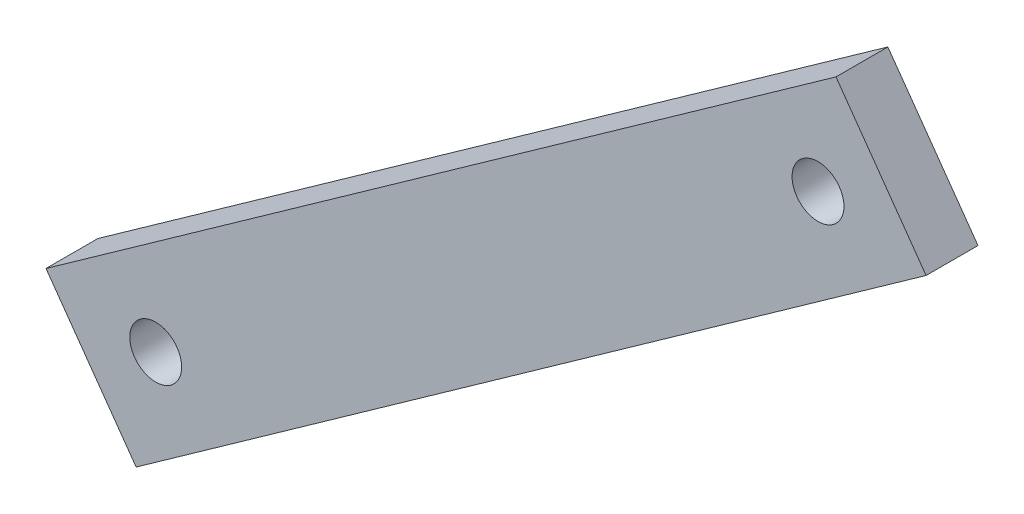
ISO-10303-21;
HEADER;
FILE_DESCRIPTION(('STEP AP214'),'2;1');
FILE_NAME('part.step','',(''),(''),'','','');
FILE_SCHEMA(('AUTOMOTIVE_DESIGN { 1 0 10303 214 1 1 1 1 }'));
ENDSEC;
DATA;
#1=APPLICATION_CONTEXT('core data for automotive mechanical design processes');
#2=APPLICATION_PROTOCOL_DEFINITION('international standard','automotive_design',2000,#1);
#3=PRODUCT_CONTEXT('',#1,'mechanical');
#4=PRODUCT('Part','Part','',(#3));
#5=PRODUCT_RELATED_PRODUCT_CATEGORY('part','',(#4));
#6=PRODUCT_DEFINITION_FORMATION('','',#4);
#7=PRODUCT_DEFINITION_CONTEXT('part definition',#1,'design');
#8=PRODUCT_DEFINITION('design','',#6,#7);
#9=PRODUCT_DEFINITION_SHAPE('','',#8);
#10=(LENGTH_UNIT() NAMED_UNIT(*) SI_UNIT(.MILLI.,.METRE.));
#11=(NAMED_UNIT(*) PLANE_ANGLE_UNIT() SI_UNIT($,.RADIAN.));
#12=(NAMED_UNIT(*) SI_UNIT($,.STERADIAN.) SOLID_ANGLE_UNIT());
#13=UNCERTAINTY_MEASURE_WITH_UNIT(LENGTH_MEASURE(1.E-05),#10,'distance_accuracy_value','');
#14=(GEOMETRIC_REPRESENTATION_CONTEXT(3) GLOBAL_UNCERTAINTY_ASSIGNED_CONTEXT((#13)) GLOBAL_UNIT_ASSIGNED_CONTEXT((#10,
#11,#12)) REPRESENTATION_CONTEXT('',''));
#15=CARTESIAN_POINT('',(0.,0.,0.));
#16=DIRECTION('',(0.,0.,1.));
#17=DIRECTION('',(1.,0.,0.));
#18=AXIS2_PLACEMENT_3D('',#15,#16,#17);
#19=CARTESIAN_POINT('',(-63.3952831679543,2.2391287180899,2.54));
#20=DIRECTION('',(-0.578921919080397,0.815382984620276,0.));
#21=DIRECTION('',(-0.815382984620276,-0.578921919080397,0.));
#22=AXIS2_PLACEMENT_3D('',#19,#20,#21);
#23=PLANE('',#22);
#24=DIRECTION('',(0.815382984620276,0.578921919080397,0.));
#25=VECTOR('',#24,1.);
#26=CARTESIAN_POINT('',(-63.3952831679543,2.2391287180899,0.));
#27=LINE('',#26,#25);
#28=CARTESIAN_POINT('',(-63.3952831679543,2.2391287180899,0.));
#29=VERTEX_POINT('',#28);
#30=CARTESIAN_POINT('',(-24.7283543478885,29.6926481803367,0.));
#31=VERTEX_POINT('',#30);
#32=EDGE_CURVE('E95',#29,#31,#27,.T.);
#33=ORIENTED_EDGE('',*,*,#32,.T.);
#34=DIRECTION('',(0.,0.,-1.));
#35=VECTOR('',#34,1.);
#36=CARTESIAN_POINT('',(-24.7283543478885,29.6926481803367,2.54));
#37=LINE('',#36,#35);
#38=CARTESIAN_POINT('',(-24.7283543478885,29.6926481803367,2.54));
#39=VERTEX_POINT('',#38);
#40=EDGE_CURVE('E11',#39,#31,#37,.T.);
#41=ORIENTED_EDGE('',*,*,#40,.F.);
#42=DIRECTION('',(0.815382984620276,0.578921919080397,0.));
#43=VECTOR('',#42,1.);
#44=CARTESIAN_POINT('',(-63.3952831679543,2.2391287180899,2.54));
#45=LINE('',#44,#43);
#46=CARTESIAN_POINT('',(-63.3952831679543,2.2391287180899,2.54));
#47=VERTEX_POINT('',#46);
#48=EDGE_CURVE('E80',#47,#39,#45,.T.);
#49=ORIENTED_EDGE('',*,*,#48,.F.);
#50=DIRECTION('',(0.,0.,-1.));
#51=VECTOR('',#50,1.);
#52=CARTESIAN_POINT('',(-63.3952831679543,2.2391287180899,2.54));
#53=LINE('',#52,#51);
#54=EDGE_CURVE('E91',#47,#29,#53,.T.);
#55=ORIENTED_EDGE('',*,*,#54,.T.);
#56=EDGE_LOOP('',(#33,#41,#49,#55));
#57=FACE_BOUND('',#56,.T.);
#58=ADVANCED_FACE('F33',(#57),#23,.F.);
#59=CARTESIAN_POINT('',(-24.7283543478885,29.6926481803367,2.54));
#60=DIRECTION('',(-0.815382984620276,-0.578921919080398,0.));
#61=DIRECTION('',(0.578921919080397,-0.815382984620276,0.));
#62=AXIS2_PLACEMENT_3D('',#59,#60,#61);
#63=PLANE('',#62);
#64=DIRECTION('',(-0.578921919080397,0.815382984620276,0.));
#65=VECTOR('',#64,1.);
#66=CARTESIAN_POINT('',(-24.7283543478885,29.6926481803367,0.));
#67=LINE('',#66,#65);
#68=CARTESIAN_POINT('',(-29.1397393712811,35.9058665231432,0.));
#69=VERTEX_POINT('',#68);
#70=EDGE_CURVE('E85',#31,#69,#67,.T.);
#71=ORIENTED_EDGE('',*,*,#70,.T.);
#72=DIRECTION('',(0.,0.,-1.));
#73=VECTOR('',#72,1.);
#74=CARTESIAN_POINT('',(-29.1397393712811,35.9058665231432,2.54));
#75=LINE('',#74,#73);
#76=CARTESIAN_POINT('',(-29.1397393712811,35.9058665231432,2.54));
#77=VERTEX_POINT('',#76);
#78=EDGE_CURVE('E41',#77,#69,#75,.T.);
#79=ORIENTED_EDGE('',*,*,#78,.F.);
#80=DIRECTION('',(-0.578921919080397,0.815382984620276,0.));
#81=VECTOR('',#80,1.);
#82=CARTESIAN_POINT('',(-24.7283543478885,29.6926481803367,2.54));
#83=LINE('',#82,#81);
#84=EDGE_CURVE('E75',#39,#77,#83,.T.);
#85=ORIENTED_EDGE('',*,*,#84,.F.);
#86=ORIENTED_EDGE('',*,*,#40,.T.);
#87=EDGE_LOOP('',(#71,#79,#85,#86));
#88=FACE_BOUND('',#87,.T.);
#89=ADVANCED_FACE('F84',(#88),#63,.F.);
#90=CARTESIAN_POINT('',(-67.8066681913469,8.45234706089641,2.54));
#91=DIRECTION('',(-0.578921919080397,0.815382984620277,0.));
#92=DIRECTION('',(-0.815382984620277,-0.578921919080397,0.));
#93=AXIS2_PLACEMENT_3D('',#90,#91,#92);
#94=PLANE('',#93);
#95=DIRECTION('',(0.815382984620277,0.578921919080397,0.));
#96=VECTOR('',#95,1.);
#97=CARTESIAN_POINT('',(-67.8066681913469,8.45234706089641,0.));
#98=LINE('',#97,#96);
#99=CARTESIAN_POINT('',(-67.8066681913469,8.45234706089641,0.));
#100=VERTEX_POINT('',#99);
#101=EDGE_CURVE('E100',#100,#69,#98,.T.);
#102=ORIENTED_EDGE('',*,*,#101,.F.);
#103=DIRECTION('',(0.,0.,-1.));
#104=VECTOR('',#103,1.);
#105=CARTESIAN_POINT('',(-67.8066681913469,8.45234706089641,2.54));
#106=LINE('',#105,#104);
#107=CARTESIAN_POINT('',(-67.8066681913469,8.45234706089641,2.54));
#108=VERTEX_POINT('',#107);
#109=EDGE_CURVE('E65',#108,#100,#106,.T.);
#110=ORIENTED_EDGE('',*,*,#109,.F.);
#111=DIRECTION('',(0.815382984620277,0.578921919080397,0.));
#112=VECTOR('',#111,1.);
#113=CARTESIAN_POINT('',(-67.8066681913469,8.45234706089641,2.54));
#114=LINE('',#113,#112);
#115=EDGE_CURVE('E78',#108,#77,#114,.T.);
#116=ORIENTED_EDGE('',*,*,#115,.T.);
#117=ORIENTED_EDGE('',*,*,#78,.T.);
#118=EDGE_LOOP('',(#102,#110,#116,#117));
#119=FACE_BOUND('',#118,.T.);
#120=ADVANCED_FACE('F89',(#119),#94,.T.);
#121=CARTESIAN_POINT('',(-67.8066681913469,8.45234706089641,2.54));
#122=DIRECTION('',(0.815382984620277,0.578921919080397,0.));
#123=DIRECTION('',(-0.578921919080397,0.815382984620277,0.));
#124=AXIS2_PLACEMENT_3D('',#121,#122,#123);
#125=PLANE('',#124);
#126=DIRECTION('',(0.578921919080397,-0.815382984620276,0.));
#127=VECTOR('',#126,1.);
#128=CARTESIAN_POINT('',(-67.8066681913469,8.45234706089641,0.));
#129=LINE('',#128,#127);
#130=EDGE_CURVE('E68',#100,#29,#129,.T.);
#131=ORIENTED_EDGE('',*,*,#130,.T.);
#132=ORIENTED_EDGE('',*,*,#54,.F.);
#133=DIRECTION('',(0.578921919080397,-0.815382984620276,0.));
#134=VECTOR('',#133,1.);
#135=CARTESIAN_POINT('',(-67.8066681913469,8.45234706089641,2.54));
#136=LINE('',#135,#134);
#137=EDGE_CURVE('E49',#108,#47,#136,.T.);
#138=ORIENTED_EDGE('',*,*,#137,.F.);
#139=ORIENTED_EDGE('',*,*,#109,.T.);
#140=EDGE_LOOP('',(#131,#132,#138,#139));
#141=FACE_BOUND('',#140,.T.);
#142=ADVANCED_FACE('F119',(#141),#125,.F.);
#143=CARTESIAN_POINT('',(0.,0.,2.54));
#144=DIRECTION('',(0.,0.,1.));
#145=DIRECTION('',(1.,0.,0.));
#146=AXIS2_PLACEMENT_3D('',#143,#144,#145);
#147=PLANE('',#146);
#148=CARTESIAN_POINT('',(-30.0195441767285,30.6085542565678,2.54));
#149=DIRECTION('',(0.,0.,1.));
#150=DIRECTION('',(1.,0.,0.));
#151=AXIS2_PLACEMENT_3D('',#148,#149,#150);
#152=CIRCLE('',#151,1.27);
#153=CARTESIAN_POINT('',(-28.7495441767285,30.6085542565678,2.54));
#154=VERTEX_POINT('',#153);
#155=EDGE_CURVE('E98',#154,#154,#152,.F.);
#156=ORIENTED_EDGE('',*,*,#155,.T.);
#157=EDGE_LOOP('',(#156));
#158=FACE_BOUND('',#157,.T.);
#159=CARTESIAN_POINT('',(-62.4374324616641,7.59185357426359,2.54));
#160=DIRECTION('',(0.,0.,1.));
#161=DIRECTION('',(1.,0.,0.));
#162=AXIS2_PLACEMENT_3D('',#159,#160,#161);
#163=CIRCLE('',#162,1.27);
#164=CARTESIAN_POINT('',(-61.1674324616641,7.59185357426359,2.54));
#165=VERTEX_POINT('',#164);
#166=EDGE_CURVE('E170',#165,#165,#163,.F.);
#167=ORIENTED_EDGE('',*,*,#166,.T.);
#168=EDGE_LOOP('',(#167));
#169=FACE_BOUND('',#168,.T.);
#170=ORIENTED_EDGE('',*,*,#48,.T.);
#171=ORIENTED_EDGE('',*,*,#84,.T.);
#172=ORIENTED_EDGE('',*,*,#115,.F.);
#173=ORIENTED_EDGE('',*,*,#137,.T.);
#174=EDGE_LOOP('',(#170,#171,#172,#173));
#175=FACE_BOUND('',#174,.T.);
#176=ADVANCED_FACE('F76',(#158,#169,#175),#147,.T.);
#177=CARTESIAN_POINT('',(0.,0.,0.));
#178=DIRECTION('',(0.,0.,1.));
#179=DIRECTION('',(1.,0.,0.));
#180=AXIS2_PLACEMENT_3D('',#177,#178,#179);
#181=PLANE('',#180);
#182=CARTESIAN_POINT('',(-30.0195441767285,30.6085542565678,0.));
#183=DIRECTION('',(0.,0.,1.));
#184=DIRECTION('',(1.,0.,0.));
#185=AXIS2_PLACEMENT_3D('',#182,#183,#184);
#186=CIRCLE('',#185,1.27);
#187=CARTESIAN_POINT('',(-28.7495441767285,30.6085542565678,0.));
#188=VERTEX_POINT('',#187);
#189=EDGE_CURVE('E169',#188,#188,#186,.T.);
#190=ORIENTED_EDGE('',*,*,#189,.T.);
#191=EDGE_LOOP('',(#190));
#192=FACE_BOUND('',#191,.T.);
#193=CARTESIAN_POINT('',(-62.4374324616641,7.59185357426359,0.));
#194=DIRECTION('',(0.,0.,1.));
#195=DIRECTION('',(1.,0.,0.));
#196=AXIS2_PLACEMENT_3D('',#193,#194,#195);
#197=CIRCLE('',#196,1.27);
#198=CARTESIAN_POINT('',(-61.1674324616641,7.59185357426359,0.));
#199=VERTEX_POINT('',#198);
#200=EDGE_CURVE('E171',#199,#199,#197,.T.);
#201=ORIENTED_EDGE('',*,*,#200,.T.);
#202=EDGE_LOOP('',(#201));
#203=FACE_BOUND('',#202,.T.);
#204=ORIENTED_EDGE('',*,*,#32,.F.);
#205=ORIENTED_EDGE('',*,*,#130,.F.);
#206=ORIENTED_EDGE('',*,*,#101,.T.);
#207=ORIENTED_EDGE('',*,*,#70,.F.);
#208=EDGE_LOOP('',(#204,#205,#206,#207));
#209=FACE_BOUND('',#208,.T.);
#210=ADVANCED_FACE('F107',(#192,#203,#209),#181,.F.);
#211=CARTESIAN_POINT('',(-62.4374324616641,7.59185357426359,3.302));
#212=DIRECTION('',(0.,0.,-1.));
#213=DIRECTION('',(-1.,0.,0.));
#214=AXIS2_PLACEMENT_3D('',#211,#212,#213);
#215=CYLINDRICAL_SURFACE('',#214,1.27);
#216=ORIENTED_EDGE('',*,*,#166,.F.);
#217=EDGE_LOOP('',(#216));
#218=FACE_BOUND('',#217,.T.);
#219=ORIENTED_EDGE('',*,*,#200,.F.);
#220=EDGE_LOOP('',(#219));
#221=FACE_BOUND('',#220,.T.);
#222=ADVANCED_FACE('F109',(#218,#221),#215,.F.);
#223=CARTESIAN_POINT('',(-30.0195441767285,30.6085542565678,3.302));
#224=DIRECTION('',(0.,0.,-1.));
#225=DIRECTION('',(-1.,0.,0.));
#226=AXIS2_PLACEMENT_3D('',#223,#224,#225);
#227=CYLINDRICAL_SURFACE('',#226,1.27);
#228=ORIENTED_EDGE('',*,*,#155,.F.);
#229=EDGE_LOOP('',(#228));
#230=FACE_BOUND('',#229,.T.);
#231=ORIENTED_EDGE('',*,*,#189,.F.);
#232=EDGE_LOOP('',(#231));
#233=FACE_BOUND('',#232,.T.);
#234=ADVANCED_FACE('F116',(#230,#233),#227,.F.);
#235=CLOSED_SHELL('',(#58,#89,#120,#142,#176,#210,#222,#234));
#236=MANIFOLD_SOLID_BREP('B2',#235);
#237=ADVANCED_BREP_SHAPE_REPRESENTATION('',(#18,#236),#14);
#238=SHAPE_DEFINITION_REPRESENTATION(#9,#237);
ENDSEC;
END-ISO-10303-21;
